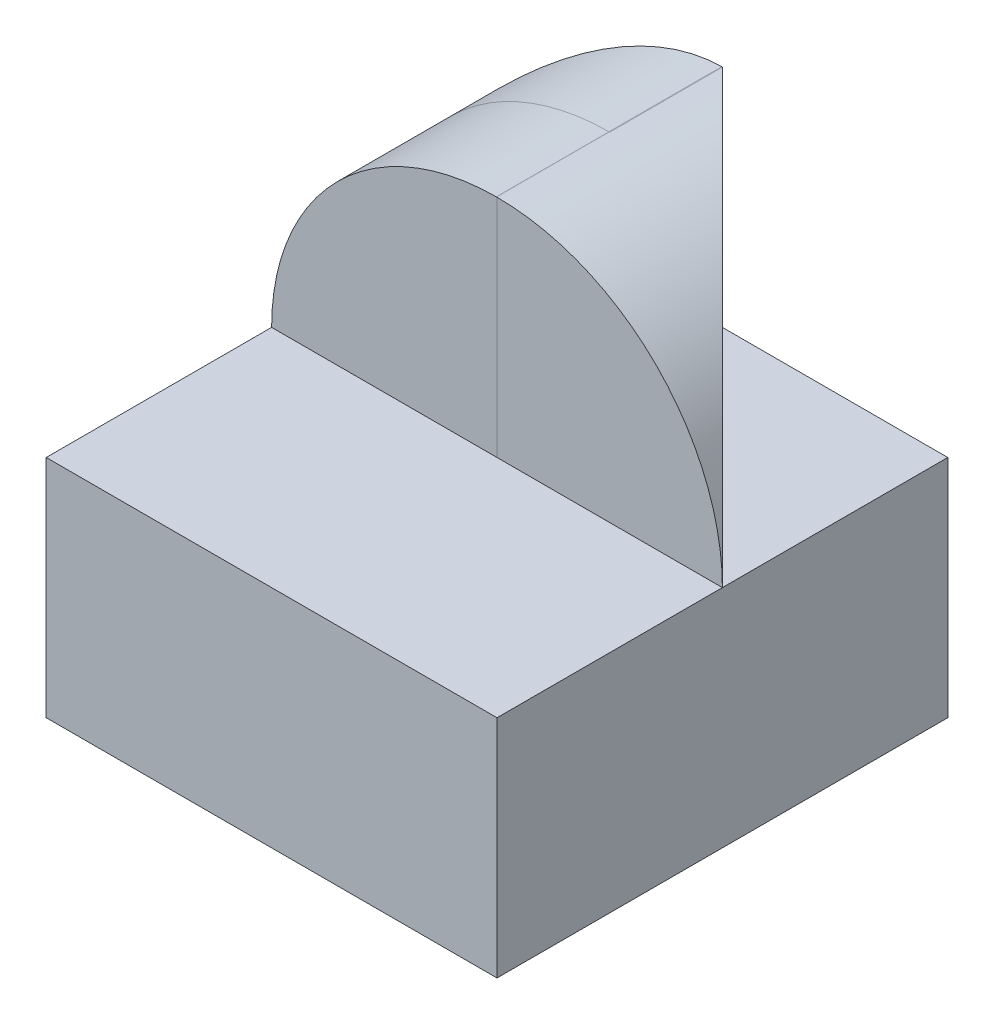
ISO-10303-21;
HEADER;
FILE_DESCRIPTION(('STEP AP214'),'2;1');
FILE_NAME('part.step','',(''),(''),'','','');
FILE_SCHEMA(('AUTOMOTIVE_DESIGN { 1 0 10303 214 1 1 1 1 }'));
ENDSEC;
DATA;
#1=APPLICATION_CONTEXT('core data for automotive mechanical design processes');
#2=APPLICATION_PROTOCOL_DEFINITION('international standard','automotive_design',2000,#1);
#3=PRODUCT_CONTEXT('',#1,'mechanical');
#4=PRODUCT('Part','Part','',(#3));
#5=PRODUCT_RELATED_PRODUCT_CATEGORY('part','',(#4));
#6=PRODUCT_DEFINITION_FORMATION('','',#4);
#7=PRODUCT_DEFINITION_CONTEXT('part definition',#1,'design');
#8=PRODUCT_DEFINITION('design','',#6,#7);
#9=PRODUCT_DEFINITION_SHAPE('','',#8);
#10=(LENGTH_UNIT() NAMED_UNIT(*) SI_UNIT(.MILLI.,.METRE.));
#11=(NAMED_UNIT(*) PLANE_ANGLE_UNIT() SI_UNIT($,.RADIAN.));
#12=(NAMED_UNIT(*) SI_UNIT($,.STERADIAN.) SOLID_ANGLE_UNIT());
#13=UNCERTAINTY_MEASURE_WITH_UNIT(LENGTH_MEASURE(1.E-05),#10,'distance_accuracy_value','');
#14=(GEOMETRIC_REPRESENTATION_CONTEXT(3) GLOBAL_UNCERTAINTY_ASSIGNED_CONTEXT((#13)) GLOBAL_UNIT_ASSIGNED_CONTEXT((#10,
#11,#12)) REPRESENTATION_CONTEXT('',''));
#15=CARTESIAN_POINT('',(0.,0.,0.));
#16=DIRECTION('',(0.,0.,1.));
#17=DIRECTION('',(1.,0.,0.));
#18=AXIS2_PLACEMENT_3D('',#15,#16,#17);
#19=CARTESIAN_POINT('',(20.,20.,10.));
#20=DIRECTION('',(0.,0.,-1.));
#21=DIRECTION('',(-1.,0.,0.));
#22=AXIS2_PLACEMENT_3D('',#19,#20,#21);
#23=CYLINDRICAL_SURFACE('',#22,20.);
#24=DIRECTION('',(0.,0.,-1.));
#25=VECTOR('',#24,1.);
#26=CARTESIAN_POINT('',(19.9593995923393,39.99995879013,10.));
#27=LINE('',#26,#25);
#28=CARTESIAN_POINT('',(19.9593995923393,39.9999587901298,19.9999));
#29=VERTEX_POINT('',#28);
#30=CARTESIAN_POINT('',(19.9593995923393,39.999929395065,10.));
#31=VERTEX_POINT('',#30);
#32=EDGE_CURVE('E211',#29,#31,#27,.T.);
#33=ORIENTED_EDGE('',*,*,#32,.F.);
#34=CARTESIAN_POINT('',(19.9999999999998,20.,19.9999));
#35=DIRECTION('',(0.,0.,-1.));
#36=DIRECTION('',(-1.,0.,0.));
#37=AXIS2_PLACEMENT_3D('',#34,#35,#36);
#38=CIRCLE('',#37,19.9999999999998);
#39=CARTESIAN_POINT('',(19.9999427197359,40.000000002177,19.9998289562371));
#40=VERTEX_POINT('',#39);
#41=EDGE_CURVE('E216',#40,#29,#38,.F.);
#42=ORIENTED_EDGE('',*,*,#41,.F.);
#43=CARTESIAN_POINT('',(20.,20.,20.));
#44=DIRECTION('',(0.,0.,-1.));
#45=DIRECTION('',(1.,0.,0.));
#46=AXIS2_PLACEMENT_3D('',#43,#44,#45);
#47=CIRCLE('',#46,20.);
#48=CARTESIAN_POINT('',(39.9999999875,20.0009999999994,20.));
#49=VERTEX_POINT('',#48);
#50=EDGE_CURVE('E389',#40,#49,#47,.T.);
#51=ORIENTED_EDGE('',*,*,#50,.T.);
#52=CARTESIAN_POINT('',(40.,20.,20.));
#53=VERTEX_POINT('',#52);
#54=EDGE_CURVE('E447',#49,#53,#47,.T.);
#55=ORIENTED_EDGE('',*,*,#54,.T.);
#56=CARTESIAN_POINT('',(20.,20.,2.16840434497101E-13));
#57=DIRECTION('',(-0.707106781186544,0.,0.707106781186551));
#58=DIRECTION('',(-0.707106781186551,0.,-0.707106781186544));
#59=AXIS2_PLACEMENT_3D('',#56,#57,#58);
#60=ELLIPSE('',#59,28.2842712474617,20.);
#61=CARTESIAN_POINT('',(39.999999975,20.0009999999975,19.999999975));
#62=VERTEX_POINT('',#61);
#63=EDGE_CURVE('E438',#62,#53,#60,.F.);
#64=ORIENTED_EDGE('',*,*,#63,.F.);
#65=CARTESIAN_POINT('',(20.0002057949251,39.9999999989412,0.000205794925286198));
#66=VERTEX_POINT('',#65);
#67=EDGE_CURVE('E397',#66,#62,#60,.F.);
#68=ORIENTED_EDGE('',*,*,#67,.F.);
#69=DIRECTION('',(0.,0.,-1.));
#70=VECTOR('',#69,1.);
#71=CARTESIAN_POINT('',(20.0002057949251,39.9999999989412,10.));
#72=LINE('',#71,#70);
#73=CARTESIAN_POINT('',(20.0000854952938,40.0000050290785,10.));
#74=VERTEX_POINT('',#73);
#75=EDGE_CURVE('E913',#66,#74,#72,.F.);
#76=ORIENTED_EDGE('',*,*,#75,.T.);
#77=CARTESIAN_POINT('',(19.9820446588261,39.9999,10.));
#78=DIRECTION('',(1.,0.,0.));
#79=VECTOR('',#78,1.);
#80=LINE('',#77,#79);
#81=CARTESIAN_POINT('',(19.9820446588261,39.9999060448939,10.));
#82=VERTEX_POINT('',#81);
#83=EDGE_CURVE('E242',#82,#74,#80,.T.);
#84=ORIENTED_EDGE('',*,*,#83,.F.);
#85=CARTESIAN_POINT('',(19.9593995923393,39.9999,10.));
#86=DIRECTION('',(1.,0.,0.));
#87=VECTOR('',#86,1.);
#88=LINE('',#85,#87);
#89=EDGE_CURVE('E53',#31,#82,#88,.T.);
#90=ORIENTED_EDGE('',*,*,#89,.F.);
#91=EDGE_LOOP('',(#33,#42,#51,#55,#64,#68,#76,#84,#90));
#92=FACE_BOUND('',#91,.T.);
#93=ADVANCED_FACE('F33',(#92),#23,.T.);
#94=CARTESIAN_POINT('',(19.9999999999998,20.,20.0005108840137));
#95=DIRECTION('',(7.27600485452626E-06,0.707112174351493,0.707101387943033));
#96=DIRECTION('',(-7.27589386473492E-06,-0.7071013879056,0.707112174388927));
#97=AXIS2_PLACEMENT_3D('',#94,#95,#96);
#98=ELLIPSE('',#97,28.2844869788476,19.9999999999998);
#99=CARTESIAN_POINT('',(2.67985945387078,30.0006365528588,9.9999));
#100=VERTEX_POINT('',#99);
#101=CARTESIAN_POINT('',(19.9367545259181,39.9999,0.000306448299358166));
#102=VERTEX_POINT('',#101);
#103=EDGE_CURVE('E252',#100,#102,#98,.F.);
#104=ORIENTED_EDGE('',*,*,#103,.F.);
#105=CARTESIAN_POINT('',(19.9999999999998,19.9999999999981,9.9999));
#106=DIRECTION('',(0.,0.,1.));
#107=DIRECTION('',(1.,0.,0.));
#108=AXIS2_PLACEMENT_3D('',#105,#106,#107);
#109=CIRCLE('',#108,20.0000000000019);
#110=CARTESIAN_POINT('',(19.9367545258525,39.9999,9.9999));
#111=VERTEX_POINT('',#110);
#112=EDGE_CURVE('E227',#111,#100,#109,.T.);
#113=ORIENTED_EDGE('',*,*,#112,.F.);
#114=DIRECTION('',(0.,0.,-1.));
#115=VECTOR('',#114,1.);
#116=CARTESIAN_POINT('',(19.9367545258525,39.9999,10.));
#117=LINE('',#116,#115);
#118=EDGE_CURVE('E247',#111,#102,#117,.T.);
#119=ORIENTED_EDGE('',*,*,#118,.T.);
#120=EDGE_LOOP('',(#104,#113,#119));
#121=FACE_BOUND('',#120,.T.);
#122=ADVANCED_FACE('F542',(#121),#23,.T.);
#123=CARTESIAN_POINT('',(-2979.99999983804,20.0311743276517,20.0002057904996));
#124=DIRECTION('',(7.27600485452626E-06,0.707112174351493,0.707101387943033));
#125=DIRECTION('',(0.,-0.70710138796175,0.70711217437021));
#126=AXIS2_PLACEMENT_3D('',#123,#124,#125);
#127=PLANE('',#126);
#128=DIRECTION('',(0.999999999947061,-1.02897462638287E-05,0.));
#129=VECTOR('',#128,1.);
#130=CARTESIAN_POINT('',(-2979.999896939,30.03132757074,9.9999));
#131=LINE('',#130,#129);
#132=CARTESIAN_POINT('',(19.9683756544016,30.0004586584138,9.9999));
#133=VERTEX_POINT('',#132);
#134=EDGE_CURVE('E237',#100,#133,#131,.T.);
#135=ORIENTED_EDGE('',*,*,#134,.F.);
#136=ORIENTED_EDGE('',*,*,#103,.T.);
#137=DIRECTION('',(-0.999999999947059,0.,1.02899032277493E-05));
#138=VECTOR('',#137,1.);
#139=CARTESIAN_POINT('',(-2980.00020531743,39.9999,0.0311755093071291));
#140=LINE('',#139,#138);
#141=CARTESIAN_POINT('',(20.,39.99995,0.000255796746828963));
#142=VERTEX_POINT('',#141);
#143=EDGE_CURVE('E11',#142,#102,#140,.T.);
#144=ORIENTED_EDGE('',*,*,#143,.F.);
#145=DIRECTION('',(0.999999999947061,-1.0289746263742E-05,0.));
#146=VECTOR('',#145,1.);
#147=CARTESIAN_POINT('',(0.000205795983861806,40.0002057938665,0.000205794925287933));
#148=LINE('',#147,#146);
#149=EDGE_CURVE('E273',#142,#66,#148,.T.);
#150=ORIENTED_EDGE('',*,*,#149,.T.);
#151=DIRECTION('',(-7.27589386462909E-06,-0.7071013879056,0.707112174388927));
#152=VECTOR('',#151,1.);
#153=CARTESIAN_POINT('',(20.0000000031391,20.0003050888605,20.0002057904993));
#154=LINE('',#153,#152);
#155=CARTESIAN_POINT('',(20.0000000102896,20.0010000010587,19.9995108677005));
#156=VERTEX_POINT('',#155);
#157=EDGE_CURVE('E272',#66,#156,#154,.T.);
#158=ORIENTED_EDGE('',*,*,#157,.T.);
#159=DIRECTION('',(0.99999999994706,-1.0289746263742E-05,0.));
#160=VECTOR('',#159,1.);
#161=CARTESIAN_POINT('',(-2979.99999983089,20.0318692398499,19.9995108677008));
#162=LINE('',#161,#160);
#163=CARTESIAN_POINT('',(-0.000143499421172494,20.0003165753148,19.9999907034279));
#164=VERTEX_POINT('',#163);
#165=EDGE_CURVE('E276',#164,#156,#162,.T.);
#166=ORIENTED_EDGE('',*,*,#165,.F.);
#167=CARTESIAN_POINT('',(2.67980171555224,30.0005365549783,10.));
#168=VERTEX_POINT('',#167);
#169=EDGE_CURVE('E253',#164,#168,#98,.F.);
#170=ORIENTED_EDGE('',*,*,#169,.T.);
#171=DIRECTION('',(0.999999999947061,-1.02897462638287E-05,0.));
#172=VECTOR('',#171,1.);
#173=CARTESIAN_POINT('',(-2979.99989694003,30.0312275722654,10.));
#174=LINE('',#173,#172);
#175=CARTESIAN_POINT('',(19.9683759706259,30.000358659936,10.));
#176=VERTEX_POINT('',#175);
#177=EDGE_CURVE('E230',#168,#176,#174,.T.);
#178=ORIENTED_EDGE('',*,*,#177,.T.);
#179=DIRECTION('',(-0.00223605375418481,0.707099631732948,-0.707110395105841));
#180=VECTOR('',#179,1.);
#181=CARTESIAN_POINT('',(19.9849504183027,24.7590777527241,15.2413606892657));
#182=LINE('',#181,#180);
#183=EDGE_CURVE('E239',#176,#133,#182,.T.);
#184=ORIENTED_EDGE('',*,*,#183,.T.);
#185=EDGE_LOOP('',(#135,#136,#144,#150,#158,#166,#170,#178,#184));
#186=FACE_BOUND('',#185,.T.);
#187=ADVANCED_FACE('F310',(#186),#127,.F.);
#188=CARTESIAN_POINT('',(20.0002057951134,40.0000183034798,-10.));
#189=DIRECTION('',(-0.999999999947061,1.0289746263742E-05,0.));
#190=DIRECTION('',(-1.0289746263742E-05,-0.999999999947061,0.));
#191=AXIS2_PLACEMENT_3D('',#188,#189,#190);
#192=PLANE('',#191);
#193=ORIENTED_EDGE('',*,*,#157,.F.);
#194=DIRECTION('',(-1.02897462631972E-05,-0.999999999894121,-1.02897462631971E-05));
#195=VECTOR('',#194,1.);
#196=CARTESIAN_POINT('',(20.0008437570757,101.999794187711,0.000843757075926627));
#197=LINE('',#196,#195);
#198=CARTESIAN_POINT('',(19.9999999999998,20.,0.));
#199=VERTEX_POINT('',#198);
#200=EDGE_CURVE('E532',#66,#199,#197,.T.);
#201=ORIENTED_EDGE('',*,*,#200,.T.);
#202=DIRECTION('',(0.,0.,-1.));
#203=VECTOR('',#202,1.);
#204=CARTESIAN_POINT('',(19.9999999999998,20.,0.));
#205=LINE('',#204,#203);
#206=CARTESIAN_POINT('',(19.9999999999998,19.9999999999981,10.));
#207=VERTEX_POINT('',#206);
#208=EDGE_CURVE('E526',#207,#199,#205,.T.);
#209=ORIENTED_EDGE('',*,*,#208,.F.);
#210=DIRECTION('',(-1.0289746263742E-05,-0.999999999947061,0.));
#211=VECTOR('',#210,1.);
#212=CARTESIAN_POINT('',(20.0002057951134,40.0000183034798,10.));
#213=LINE('',#212,#211);
#214=CARTESIAN_POINT('',(20.0000000102896,20.0010000010587,10.));
#215=VERTEX_POINT('',#214);
#216=EDGE_CURVE('E285',#215,#207,#213,.T.);
#217=ORIENTED_EDGE('',*,*,#216,.F.);
#218=DIRECTION('',(0.,0.,1.));
#219=VECTOR('',#218,1.);
#220=CARTESIAN_POINT('',(20.0000000102896,20.0010000010587,0.));
#221=LINE('',#220,#219);
#222=EDGE_CURVE('E268',#215,#156,#221,.T.);
#223=ORIENTED_EDGE('',*,*,#222,.T.);
#224=EDGE_LOOP('',(#193,#201,#209,#217,#223));
#225=FACE_BOUND('',#224,.T.);
#226=ADVANCED_FACE('F312',(#225),#192,.T.);
#227=CARTESIAN_POINT('',(19.9999999999998,40.,10.));
#228=DIRECTION('',(0.,0.,-1.));
#229=DIRECTION('',(-1.,0.,0.));
#230=AXIS2_PLACEMENT_3D('',#227,#228,#229);
#231=PLANE('',#230);
#232=DIRECTION('',(1.,0.,0.));
#233=VECTOR('',#232,1.);
#234=CARTESIAN_POINT('',(0.,20.,10.));
#235=LINE('',#234,#233);
#236=CARTESIAN_POINT('',(-0.000467023133326176,20.0009611747016,9.99999999999999));
#237=VERTEX_POINT('',#236);
#238=EDGE_CURVE('E45',#237,#207,#235,.T.);
#239=ORIENTED_EDGE('',*,*,#238,.F.);
#240=DIRECTION('',(0.99999999994706,-1.0289746263742E-05,0.));
#241=VECTOR('',#240,1.);
#242=CARTESIAN_POINT('',(-2979.99999983089,20.0318692398499,10.0000000000003));
#243=LINE('',#242,#241);
#244=EDGE_CURVE('E282',#237,#215,#243,.T.);
#245=ORIENTED_EDGE('',*,*,#244,.T.);
#246=ORIENTED_EDGE('',*,*,#216,.T.);
#247=EDGE_LOOP('',(#239,#245,#246));
#248=FACE_BOUND('',#247,.T.);
#249=ADVANCED_FACE('F315',(#248),#231,.T.);
#250=DIRECTION('',(0.,0.,-1.));
#251=VECTOR('',#250,1.);
#252=CARTESIAN_POINT('',(19.9367545258525,39.9999,10.));
#253=LINE('',#252,#251);
#254=CARTESIAN_POINT('',(19.9367545258525,39.9999,10.));
#255=VERTEX_POINT('',#254);
#256=CARTESIAN_POINT('',(19.9367545259183,39.9999,19.9999));
#257=VERTEX_POINT('',#256);
#258=EDGE_CURVE('E202',#255,#257,#253,.F.);
#259=ORIENTED_EDGE('',*,*,#258,.F.);
#260=CARTESIAN_POINT('',(19.9999999999998,19.9999999999981,10.));
#261=DIRECTION('',(0.,0.,1.));
#262=DIRECTION('',(1.,0.,0.));
#263=AXIS2_PLACEMENT_3D('',#260,#261,#262);
#264=CIRCLE('',#263,20.0000000000019);
#265=EDGE_CURVE('E228',#255,#168,#264,.T.);
#266=ORIENTED_EDGE('',*,*,#265,.T.);
#267=ORIENTED_EDGE('',*,*,#169,.F.);
#268=EDGE_CURVE('E256',#257,#164,#38,.F.);
#269=ORIENTED_EDGE('',*,*,#268,.F.);
#270=EDGE_LOOP('',(#259,#266,#267,#269));
#271=FACE_BOUND('',#270,.T.);
#272=ADVANCED_FACE('F337',(#271),#23,.T.);
#273=CARTESIAN_POINT('',(9.99999999999979,102.,-9.99999999999989));
#274=DIRECTION('',(-0.707106781186544,0.,0.707106781186551));
#275=DIRECTION('',(0.707106781186551,0.,0.707106781186544));
#276=AXIS2_PLACEMENT_3D('',#273,#274,#275);
#277=PLANE('',#276);
#278=ORIENTED_EDGE('',*,*,#200,.F.);
#279=ORIENTED_EDGE('',*,*,#67,.T.);
#280=ORIENTED_EDGE('',*,*,#63,.T.);
#281=DIRECTION('',(0.707106781186551,0.,0.707106781186544));
#282=VECTOR('',#281,1.);
#283=CARTESIAN_POINT('',(19.9999999999998,20.,0.));
#284=LINE('',#283,#282);
#285=EDGE_CURVE('E493',#199,#53,#284,.T.);
#286=ORIENTED_EDGE('',*,*,#285,.F.);
#287=EDGE_LOOP('',(#278,#279,#280,#286));
#288=FACE_BOUND('',#287,.T.);
#289=ADVANCED_FACE('F530',(#288),#277,.F.);
#290=CARTESIAN_POINT('',(42.,20.,20.));
#291=DIRECTION('',(0.,0.,1.));
#292=DIRECTION('',(1.,0.,0.));
#293=AXIS2_PLACEMENT_3D('',#290,#291,#292);
#294=PLANE('',#293);
#295=DIRECTION('',(-0.70693002659386,-0.707283491607153,0.));
#296=VECTOR('',#295,1.);
#297=CARTESIAN_POINT('',(40.9919216222216,21.0075745904832,20.));
#298=LINE('',#297,#296);
#299=CARTESIAN_POINT('',(20.,0.00515700745054234,20.));
#300=VERTEX_POINT('',#299);
#301=CARTESIAN_POINT('',(19.9948455697646,0.,20.));
#302=VERTEX_POINT('',#301);
#303=EDGE_CURVE('E411',#300,#302,#298,.T.);
#304=ORIENTED_EDGE('',*,*,#303,.F.);
#305=DIRECTION('',(0.,-1.,0.));
#306=VECTOR('',#305,1.);
#307=CARTESIAN_POINT('',(20.,20.,20.));
#308=LINE('',#307,#306);
#309=CARTESIAN_POINT('',(20.,0.,20.));
#310=VERTEX_POINT('',#309);
#311=EDGE_CURVE('E593',#300,#310,#308,.T.);
#312=ORIENTED_EDGE('',*,*,#311,.T.);
#313=DIRECTION('',(-1.,0.,0.));
#314=VECTOR('',#313,1.);
#315=CARTESIAN_POINT('',(42.,0.,20.));
#316=LINE('',#315,#314);
#317=EDGE_CURVE('E491',#310,#302,#316,.T.);
#318=ORIENTED_EDGE('',*,*,#317,.T.);
#319=EDGE_LOOP('',(#304,#312,#318));
#320=FACE_BOUND('',#319,.T.);
#321=ADVANCED_FACE('F554',(#320),#294,.F.);
#322=CARTESIAN_POINT('',(42.,20.,10.));
#323=DIRECTION('',(0.,0.,-1.));
#324=DIRECTION('',(0.,1.,0.));
#325=AXIS2_PLACEMENT_3D('',#322,#323,#324);
#326=PLANE('',#325);
#327=DIRECTION('',(0.707106781186547,-0.707106781186548,0.));
#328=VECTOR('',#327,1.);
#329=CARTESIAN_POINT('',(0.,20.,10.));
#330=LINE('',#329,#328);
#331=CARTESIAN_POINT('',(19.9974221407395,0.00257785926045459,10.));
#332=VERTEX_POINT('',#331);
#333=CARTESIAN_POINT('',(20.,0.,10.));
#334=VERTEX_POINT('',#333);
#335=EDGE_CURVE('E381',#332,#334,#330,.T.);
#336=ORIENTED_EDGE('',*,*,#335,.T.);
#337=DIRECTION('',(0.,1.,0.));
#338=VECTOR('',#337,1.);
#339=CARTESIAN_POINT('',(20.,20.,10.));
#340=LINE('',#339,#338);
#341=CARTESIAN_POINT('',(20.,0.00515700745054234,10.));
#342=VERTEX_POINT('',#341);
#343=EDGE_CURVE('E598',#334,#342,#340,.T.);
#344=ORIENTED_EDGE('',*,*,#343,.T.);
#345=DIRECTION('',(0.70693002659386,0.707283491607153,0.));
#346=VECTOR('',#345,1.);
#347=CARTESIAN_POINT('',(40.9919216222216,21.0075745904832,10.));
#348=LINE('',#347,#346);
#349=EDGE_CURVE('E405',#332,#342,#348,.T.);
#350=ORIENTED_EDGE('',*,*,#349,.F.);
#351=EDGE_LOOP('',(#336,#344,#350));
#352=FACE_BOUND('',#351,.T.);
#353=ADVANCED_FACE('F612',(#352),#326,.F.);
#354=CARTESIAN_POINT('',(0.,0.,40.));
#355=DIRECTION('',(1.,0.,0.));
#356=DIRECTION('',(0.,0.,-1.));
#357=AXIS2_PLACEMENT_3D('',#354,#355,#356);
#358=PLANE('',#357);
#359=DIRECTION('',(0.,0.,-1.));
#360=VECTOR('',#359,1.);
#361=CARTESIAN_POINT('',(0.,0.,40.));
#362=LINE('',#361,#360);
#363=CARTESIAN_POINT('',(0.,0.,40.));
#364=VERTEX_POINT('',#363);
#365=CARTESIAN_POINT('',(0.,0.,20.0004268024548));
#366=VERTEX_POINT('',#365);
#367=EDGE_CURVE('E486',#364,#366,#362,.T.);
#368=ORIENTED_EDGE('',*,*,#367,.F.);
#369=DIRECTION('',(0.,-1.,0.));
#370=VECTOR('',#369,1.);
#371=CARTESIAN_POINT('',(0.,0.,40.));
#372=LINE('',#371,#370);
#373=CARTESIAN_POINT('',(0.,20.001,40.));
#374=VERTEX_POINT('',#373);
#375=EDGE_CURVE('E489',#374,#364,#372,.T.);
#376=ORIENTED_EDGE('',*,*,#375,.F.);
#377=DIRECTION('',(0.,0.,1.));
#378=VECTOR('',#377,1.);
#379=CARTESIAN_POINT('',(0.,20.001,20.));
#380=LINE('',#379,#378);
#381=EDGE_CURVE('E429',#164,#374,#380,.T.);
#382=ORIENTED_EDGE('',*,*,#381,.F.);
#383=DIRECTION('',(0.,1.,0.));
#384=VECTOR('',#383,1.);
#385=CARTESIAN_POINT('',(0.,0.,20.0004268024548));
#386=LINE('',#385,#384);
#387=EDGE_CURVE('E416',#366,#164,#386,.T.);
#388=ORIENTED_EDGE('',*,*,#387,.F.);
#389=EDGE_LOOP('',(#368,#376,#382,#388));
#390=FACE_BOUND('',#389,.T.);
#391=ADVANCED_FACE('F512',(#390),#358,.F.);
#392=CARTESIAN_POINT('',(0.,0.,0.));
#393=DIRECTION('',(0.,0.,-1.));
#394=DIRECTION('',(-1.,0.,0.));
#395=AXIS2_PLACEMENT_3D('',#392,#393,#394);
#396=PLANE('',#395);
#397=DIRECTION('',(-1.,0.,0.));
#398=VECTOR('',#397,1.);
#399=CARTESIAN_POINT('',(0.,20.,0.));
#400=LINE('',#399,#398);
#401=CARTESIAN_POINT('',(0.,20.,0.));
#402=VERTEX_POINT('',#401);
#403=EDGE_CURVE('E523',#199,#402,#400,.T.);
#404=ORIENTED_EDGE('',*,*,#403,.F.);
#405=DIRECTION('',(-1.,0.,0.));
#406=VECTOR('',#405,1.);
#407=CARTESIAN_POINT('',(40.,20.,0.));
#408=LINE('',#407,#406);
#409=CARTESIAN_POINT('',(40.,20.,0.));
#410=VERTEX_POINT('',#409);
#411=EDGE_CURVE('E495',#410,#199,#408,.T.);
#412=ORIENTED_EDGE('',*,*,#411,.F.);
#413=DIRECTION('',(0.,1.,0.));
#414=VECTOR('',#413,1.);
#415=CARTESIAN_POINT('',(40.,0.,0.));
#416=LINE('',#415,#414);
#417=CARTESIAN_POINT('',(40.,0.,0.));
#418=VERTEX_POINT('',#417);
#419=EDGE_CURVE('E437',#418,#410,#416,.T.);
#420=ORIENTED_EDGE('',*,*,#419,.F.);
#421=DIRECTION('',(1.,0.,0.));
#422=VECTOR('',#421,1.);
#423=CARTESIAN_POINT('',(0.,0.,0.));
#424=LINE('',#423,#422);
#425=CARTESIAN_POINT('',(20.,0.,0.));
#426=VERTEX_POINT('',#425);
#427=EDGE_CURVE('E428',#426,#418,#424,.T.);
#428=ORIENTED_EDGE('',*,*,#427,.F.);
#429=DIRECTION('',(0.707106781186547,-0.707106781186548,0.));
#430=VECTOR('',#429,1.);
#431=CARTESIAN_POINT('',(0.,20.,0.));
#432=LINE('',#431,#430);
#433=CARTESIAN_POINT('',(19.9974221407395,0.00257785926045806,0.));
#434=VERTEX_POINT('',#433);
#435=EDGE_CURVE('E385',#434,#426,#432,.T.);
#436=ORIENTED_EDGE('',*,*,#435,.F.);
#437=DIRECTION('',(0.70693002659386,0.707283491607153,0.));
#438=VECTOR('',#437,1.);
#439=CARTESIAN_POINT('',(5.86381846534464,-14.1380926179721,0.));
#440=LINE('',#439,#438);
#441=CARTESIAN_POINT('',(20.,0.00515700745054495,0.));
#442=VERTEX_POINT('',#441);
#443=EDGE_CURVE('E403',#434,#442,#440,.T.);
#444=ORIENTED_EDGE('',*,*,#443,.T.);
#445=DIRECTION('',(0.,-1.,0.));
#446=VECTOR('',#445,1.);
#447=CARTESIAN_POINT('',(20.,20.,0.));
#448=LINE('',#447,#446);
#449=CARTESIAN_POINT('',(20.,0.00999500249865108,0.));
#450=VERTEX_POINT('',#449);
#451=EDGE_CURVE('E585',#450,#442,#448,.T.);
#452=ORIENTED_EDGE('',*,*,#451,.F.);
#453=DIRECTION('',(0.707283491607153,-0.70693002659386,0.));
#454=VECTOR('',#453,1.);
#455=CARTESIAN_POINT('',(-3.66085223489632E-05,20.0000365902272,0.));
#456=LINE('',#455,#454);
#457=EDGE_CURVE('E396',#402,#450,#456,.T.);
#458=ORIENTED_EDGE('',*,*,#457,.F.);
#459=EDGE_LOOP('',(#404,#412,#420,#428,#436,#444,#452,#458));
#460=FACE_BOUND('',#459,.T.);
#461=ADVANCED_FACE('F355',(#460),#396,.T.);
#462=CARTESIAN_POINT('',(0.,20.,10.));
#463=DIRECTION('',(0.707106781186548,0.707106781186547,0.));
#464=DIRECTION('',(-0.707106781186547,0.707106781186548,0.));
#465=AXIS2_PLACEMENT_3D('',#462,#463,#464);
#466=PLANE('',#465);
#467=DIRECTION('',(0.,0.,1.));
#468=VECTOR('',#467,1.);
#469=CARTESIAN_POINT('',(19.9974221407395,0.00257785926045459,10.));
#470=LINE('',#469,#468);
#471=EDGE_CURVE('E386',#434,#332,#470,.T.);
#472=ORIENTED_EDGE('',*,*,#471,.F.);
#473=ORIENTED_EDGE('',*,*,#435,.T.);
#474=DIRECTION('',(0.,0.,-1.));
#475=VECTOR('',#474,1.);
#476=CARTESIAN_POINT('',(20.,0.,10.));
#477=LINE('',#476,#475);
#478=EDGE_CURVE('E384',#334,#426,#477,.T.);
#479=ORIENTED_EDGE('',*,*,#478,.F.);
#480=ORIENTED_EDGE('',*,*,#335,.F.);
#481=EDGE_LOOP('',(#472,#473,#479,#480));
#482=FACE_BOUND('',#481,.T.);
#483=ADVANCED_FACE('F351',(#482),#466,.F.);
#484=CARTESIAN_POINT('',(0.,20.001,0.));
#485=DIRECTION('',(0.,-1.,0.));
#486=DIRECTION('',(0.,0.,-1.));
#487=AXIS2_PLACEMENT_3D('',#484,#485,#486);
#488=PLANE('',#487);
#489=DIRECTION('',(-1.,0.,0.));
#490=VECTOR('',#489,1.);
#491=CARTESIAN_POINT('',(40.,20.001,20.));
#492=LINE('',#491,#490);
#493=CARTESIAN_POINT('',(19.999985993593,20.001,20.));
#494=VERTEX_POINT('',#493);
#495=EDGE_CURVE('E454',#49,#494,#492,.T.);
#496=ORIENTED_EDGE('',*,*,#495,.T.);
#497=DIRECTION('',(1.,0.,0.));
#498=VECTOR('',#497,1.);
#499=CARTESIAN_POINT('',(0.,20.001,20.));
#500=LINE('',#499,#498);
#501=EDGE_CURVE('E513',#164,#494,#500,.T.);
#502=ORIENTED_EDGE('',*,*,#501,.F.);
#503=ORIENTED_EDGE('',*,*,#381,.T.);
#504=DIRECTION('',(1.,0.,0.));
#505=VECTOR('',#504,1.);
#506=CARTESIAN_POINT('',(40.,20.001,40.));
#507=LINE('',#506,#505);
#508=CARTESIAN_POINT('',(40.,20.001,40.));
#509=VERTEX_POINT('',#508);
#510=EDGE_CURVE('E425',#374,#509,#507,.T.);
#511=ORIENTED_EDGE('',*,*,#510,.T.);
#512=DIRECTION('',(0.,0.,-1.));
#513=VECTOR('',#512,1.);
#514=CARTESIAN_POINT('',(40.,20.001,20.));
#515=LINE('',#514,#513);
#516=EDGE_CURVE('E424',#509,#49,#515,.T.);
#517=ORIENTED_EDGE('',*,*,#516,.T.);
#518=EDGE_LOOP('',(#496,#502,#503,#511,#517));
#519=FACE_BOUND('',#518,.T.);
#520=ADVANCED_FACE('F354',(#519),#488,.F.);
#521=CARTESIAN_POINT('',(20.,20.,20.));
#522=DIRECTION('',(0.,0.,1.));
#523=DIRECTION('',(1.,0.,0.));
#524=AXIS2_PLACEMENT_3D('',#521,#522,#523);
#525=PLANE('',#524);
#526=DIRECTION('',(-1.94562443964553E-05,0.999999999810727,0.));
#527=VECTOR('',#526,1.);
#528=CARTESIAN_POINT('',(19.9999860011639,20.0006108748392,20.));
#529=LINE('',#528,#527);
#530=EDGE_CURVE('E472',#494,#40,#529,.T.);
#531=ORIENTED_EDGE('',*,*,#530,.F.);
#532=ORIENTED_EDGE('',*,*,#495,.F.);
#533=ORIENTED_EDGE('',*,*,#50,.F.);
#534=EDGE_LOOP('',(#531,#532,#533));
#535=FACE_BOUND('',#534,.T.);
#536=ADVANCED_FACE('F359',(#535),#525,.T.);
#537=CARTESIAN_POINT('',(0.,0.,40.));
#538=DIRECTION('',(0.,0.,-1.));
#539=DIRECTION('',(-1.,0.,0.));
#540=AXIS2_PLACEMENT_3D('',#537,#538,#539);
#541=PLANE('',#540);
#542=DIRECTION('',(1.,0.,0.));
#543=VECTOR('',#542,1.);
#544=CARTESIAN_POINT('',(0.,0.,40.));
#545=LINE('',#544,#543);
#546=CARTESIAN_POINT('',(40.,0.,40.));
#547=VERTEX_POINT('',#546);
#548=EDGE_CURVE('E480',#364,#547,#545,.T.);
#549=ORIENTED_EDGE('',*,*,#548,.T.);
#550=DIRECTION('',(0.,1.,0.));
#551=VECTOR('',#550,1.);
#552=CARTESIAN_POINT('',(40.,0.,40.));
#553=LINE('',#552,#551);
#554=EDGE_CURVE('E479',#547,#509,#553,.T.);
#555=ORIENTED_EDGE('',*,*,#554,.T.);
#556=ORIENTED_EDGE('',*,*,#510,.F.);
#557=ORIENTED_EDGE('',*,*,#375,.T.);
#558=EDGE_LOOP('',(#549,#555,#556,#557));
#559=FACE_BOUND('',#558,.T.);
#560=ADVANCED_FACE('F35',(#559),#541,.F.);
#561=CARTESIAN_POINT('',(40.,0.,40.));
#562=DIRECTION('',(-1.,0.,0.));
#563=DIRECTION('',(0.,0.,1.));
#564=AXIS2_PLACEMENT_3D('',#561,#562,#563);
#565=PLANE('',#564);
#566=ORIENTED_EDGE('',*,*,#516,.F.);
#567=ORIENTED_EDGE('',*,*,#554,.F.);
#568=DIRECTION('',(0.,0.,-1.));
#569=VECTOR('',#568,1.);
#570=CARTESIAN_POINT('',(40.,0.,40.));
#571=LINE('',#570,#569);
#572=EDGE_CURVE('E483',#547,#418,#571,.T.);
#573=ORIENTED_EDGE('',*,*,#572,.T.);
#574=ORIENTED_EDGE('',*,*,#419,.T.);
#575=DIRECTION('',(0.,0.,-1.));
#576=VECTOR('',#575,1.);
#577=CARTESIAN_POINT('',(40.,20.,20.));
#578=LINE('',#577,#576);
#579=EDGE_CURVE('E433',#53,#410,#578,.T.);
#580=ORIENTED_EDGE('',*,*,#579,.F.);
#581=ORIENTED_EDGE('',*,*,#54,.F.);
#582=EDGE_LOOP('',(#566,#567,#573,#574,#580,#581));
#583=FACE_BOUND('',#582,.T.);
#584=ADVANCED_FACE('F474',(#583),#565,.F.);
#585=CARTESIAN_POINT('',(0.,0.,40.));
#586=DIRECTION('',(0.,1.,0.));
#587=DIRECTION('',(0.,0.,1.));
#588=AXIS2_PLACEMENT_3D('',#585,#586,#587);
#589=PLANE('',#588);
#590=ORIENTED_EDGE('',*,*,#317,.F.);
#591=DIRECTION('',(0.,0.,-1.));
#592=VECTOR('',#591,1.);
#593=CARTESIAN_POINT('',(20.,0.,0.));
#594=LINE('',#593,#592);
#595=EDGE_CURVE('E582',#310,#334,#594,.T.);
#596=ORIENTED_EDGE('',*,*,#595,.T.);
#597=ORIENTED_EDGE('',*,*,#478,.T.);
#598=ORIENTED_EDGE('',*,*,#427,.T.);
#599=ORIENTED_EDGE('',*,*,#572,.F.);
#600=ORIENTED_EDGE('',*,*,#548,.F.);
#601=ORIENTED_EDGE('',*,*,#367,.T.);
#602=DIRECTION('',(-1.,0.,0.));
#603=VECTOR('',#602,1.);
#604=CARTESIAN_POINT('',(0.,0.,20.0004268024548));
#605=LINE('',#604,#603);
#606=CARTESIAN_POINT('',(19.9948455697646,0.,20.0004268024548));
#607=VERTEX_POINT('',#606);
#608=EDGE_CURVE('E414',#607,#366,#605,.T.);
#609=ORIENTED_EDGE('',*,*,#608,.F.);
#610=DIRECTION('',(0.,0.,1.));
#611=VECTOR('',#610,1.);
#612=CARTESIAN_POINT('',(19.9948455697646,0.,40.));
#613=LINE('',#612,#611);
#614=EDGE_CURVE('E408',#302,#607,#613,.T.);
#615=ORIENTED_EDGE('',*,*,#614,.F.);
#616=EDGE_LOOP('',(#590,#596,#597,#598,#599,#600,#601,#609,#615));
#617=FACE_BOUND('',#616,.T.);
#618=ADVANCED_FACE('F518',(#617),#589,.F.);
#619=CARTESIAN_POINT('',(0.,20.,0.));
#620=DIRECTION('',(0.,1.,0.));
#621=DIRECTION('',(0.,0.,1.));
#622=AXIS2_PLACEMENT_3D('',#619,#620,#621);
#623=PLANE('',#622);
#624=ORIENTED_EDGE('',*,*,#411,.T.);
#625=ORIENTED_EDGE('',*,*,#285,.T.);
#626=ORIENTED_EDGE('',*,*,#579,.T.);
#627=EDGE_LOOP('',(#624,#625,#626));
#628=FACE_BOUND('',#627,.T.);
#629=ADVANCED_FACE('F365',(#628),#623,.T.);
#630=CARTESIAN_POINT('',(0.,20.,20.));
#631=DIRECTION('',(0.706930026593859,0.707283491607153,0.));
#632=DIRECTION('',(-0.707283491607153,0.706930026593859,0.));
#633=AXIS2_PLACEMENT_3D('',#630,#631,#632);
#634=PLANE('',#633);
#635=ORIENTED_EDGE('',*,*,#457,.T.);
#636=DIRECTION('',(0.,0.,1.));
#637=VECTOR('',#636,1.);
#638=CARTESIAN_POINT('',(20.,0.00999500249865282,20.));
#639=LINE('',#638,#637);
#640=CARTESIAN_POINT('',(20.,0.00999500249865976,20.0004268024548));
#641=VERTEX_POINT('',#640);
#642=EDGE_CURVE('E504',#450,#641,#639,.T.);
#643=ORIENTED_EDGE('',*,*,#642,.T.);
#644=DIRECTION('',(-0.707283491607153,0.70693002659386,0.));
#645=VECTOR('',#644,1.);
#646=CARTESIAN_POINT('',(-3.66085223489632E-05,20.0000365902272,20.0004268024548));
#647=LINE('',#646,#645);
#648=EDGE_CURVE('E391',#641,#164,#647,.T.);
#649=ORIENTED_EDGE('',*,*,#648,.T.);
#650=CARTESIAN_POINT('',(0.,20.,20.));
#651=DIRECTION('',(0.,0.,-1.));
#652=VECTOR('',#651,1.);
#653=LINE('',#650,#652);
#654=EDGE_CURVE('E290',#164,#237,#653,.T.);
#655=ORIENTED_EDGE('',*,*,#654,.T.);
#656=DIRECTION('',(0.,0.,-1.));
#657=VECTOR('',#656,1.);
#658=CARTESIAN_POINT('',(0.,20.,10.));
#659=LINE('',#658,#657);
#660=EDGE_CURVE('E430',#237,#402,#659,.T.);
#661=ORIENTED_EDGE('',*,*,#660,.T.);
#662=EDGE_LOOP('',(#635,#643,#649,#655,#661));
#663=FACE_BOUND('',#662,.T.);
#664=ADVANCED_FACE('F361',(#663),#634,.F.);
#665=CARTESIAN_POINT('',(5.86381846534464,-14.1380926179721,20.0004268024548));
#666=DIRECTION('',(-0.707283491607153,0.70693002659386,0.));
#667=DIRECTION('',(-0.70693002659386,-0.707283491607153,0.));
#668=AXIS2_PLACEMENT_3D('',#665,#666,#667);
#669=PLANE('',#668);
#670=DIRECTION('',(0.,0.,1.));
#671=VECTOR('',#670,1.);
#672=CARTESIAN_POINT('',(20.,0.00515700745054234,20.0004268024548));
#673=LINE('',#672,#671);
#674=EDGE_CURVE('E596',#442,#342,#673,.T.);
#675=ORIENTED_EDGE('',*,*,#674,.F.);
#676=ORIENTED_EDGE('',*,*,#443,.F.);
#677=ORIENTED_EDGE('',*,*,#471,.T.);
#678=ORIENTED_EDGE('',*,*,#349,.T.);
#679=EDGE_LOOP('',(#675,#676,#677,#678));
#680=FACE_BOUND('',#679,.T.);
#681=ADVANCED_FACE('F346',(#680),#669,.T.);
#682=CARTESIAN_POINT('',(-14.1386371403995,5.85436675808419,20.0004268024548));
#683=DIRECTION('',(0.,0.,-1.));
#684=DIRECTION('',(-1.,0.,0.));
#685=AXIS2_PLACEMENT_3D('',#682,#683,#684);
#686=PLANE('',#685);
#687=DIRECTION('',(0.,1.,0.));
#688=VECTOR('',#687,1.);
#689=CARTESIAN_POINT('',(20.,5.85436675808419,20.0004268024548));
#690=LINE('',#689,#688);
#691=CARTESIAN_POINT('',(20.,0.00515700745054234,20.0004268024548));
#692=VERTEX_POINT('',#691);
#693=EDGE_CURVE('E587',#692,#641,#690,.T.);
#694=ORIENTED_EDGE('',*,*,#693,.F.);
#695=DIRECTION('',(0.70693002659386,0.707283491607153,0.));
#696=VECTOR('',#695,1.);
#697=CARTESIAN_POINT('',(5.86381846534464,-14.1380926179721,20.0004268024548));
#698=LINE('',#697,#696);
#699=EDGE_CURVE('E395',#607,#692,#698,.T.);
#700=ORIENTED_EDGE('',*,*,#699,.F.);
#701=ORIENTED_EDGE('',*,*,#608,.T.);
#702=ORIENTED_EDGE('',*,*,#387,.T.);
#703=ORIENTED_EDGE('',*,*,#648,.F.);
#704=EDGE_LOOP('',(#694,#700,#701,#702,#703));
#705=FACE_BOUND('',#704,.T.);
#706=ADVANCED_FACE('F343',(#705),#686,.T.);
#707=DIRECTION('',(0.,0.,1.));
#708=VECTOR('',#707,1.);
#709=CARTESIAN_POINT('',(20.,0.00515700745054234,20.0004268024548));
#710=LINE('',#709,#708);
#711=EDGE_CURVE('E388',#300,#692,#710,.T.);
#712=ORIENTED_EDGE('',*,*,#711,.F.);
#713=ORIENTED_EDGE('',*,*,#303,.T.);
#714=ORIENTED_EDGE('',*,*,#614,.T.);
#715=ORIENTED_EDGE('',*,*,#699,.T.);
#716=EDGE_LOOP('',(#712,#713,#714,#715));
#717=FACE_BOUND('',#716,.T.);
#718=ADVANCED_FACE('F341',(#717),#669,.T.);
#719=CARTESIAN_POINT('',(20.,20.,0.));
#720=DIRECTION('',(-1.,0.,0.));
#721=DIRECTION('',(0.,0.,1.));
#722=AXIS2_PLACEMENT_3D('',#719,#720,#721);
#723=PLANE('',#722);
#724=ORIENTED_EDGE('',*,*,#343,.F.);
#725=ORIENTED_EDGE('',*,*,#595,.F.);
#726=ORIENTED_EDGE('',*,*,#311,.F.);
#727=ORIENTED_EDGE('',*,*,#711,.T.);
#728=ORIENTED_EDGE('',*,*,#693,.T.);
#729=ORIENTED_EDGE('',*,*,#642,.F.);
#730=ORIENTED_EDGE('',*,*,#451,.T.);
#731=ORIENTED_EDGE('',*,*,#674,.T.);
#732=EDGE_LOOP('',(#724,#725,#726,#727,#728,#729,#730,#731));
#733=FACE_BOUND('',#732,.T.);
#734=ADVANCED_FACE('F333',(#733),#723,.T.);
#735=CARTESIAN_POINT('',(0.,20.,0.));
#736=DIRECTION('',(0.,-1.,0.));
#737=DIRECTION('',(0.,0.,-1.));
#738=AXIS2_PLACEMENT_3D('',#735,#736,#737);
#739=PLANE('',#738);
#740=ORIENTED_EDGE('',*,*,#403,.T.);
#741=ORIENTED_EDGE('',*,*,#660,.F.);
#742=ORIENTED_EDGE('',*,*,#238,.T.);
#743=ORIENTED_EDGE('',*,*,#208,.T.);
#744=EDGE_LOOP('',(#740,#741,#742,#743));
#745=FACE_BOUND('',#744,.T.);
#746=ADVANCED_FACE('F320',(#745),#739,.F.);
#747=CARTESIAN_POINT('',(19.9999860011639,20.0006108748392,19.9999));
#748=DIRECTION('',(0.,0.,-1.));
#749=DIRECTION('',(-1.,0.,0.));
#750=AXIS2_PLACEMENT_3D('',#747,#748,#749);
#751=PLANE('',#750);
#752=ORIENTED_EDGE('',*,*,#41,.T.);
#753=DIRECTION('',(0.,-1.,0.));
#754=VECTOR('',#753,1.);
#755=CARTESIAN_POINT('',(19.9593995923393,20.0006108748392,19.9999));
#756=LINE('',#755,#754);
#757=CARTESIAN_POINT('',(19.9593995923393,39.9999,19.9999));
#758=VERTEX_POINT('',#757);
#759=EDGE_CURVE('E209',#29,#758,#756,.T.);
#760=ORIENTED_EDGE('',*,*,#759,.T.);
#761=DIRECTION('',(-1.,0.,0.));
#762=VECTOR('',#761,1.);
#763=CARTESIAN_POINT('',(19.9999860011639,39.9999,19.9999));
#764=LINE('',#763,#762);
#765=EDGE_CURVE('E196',#758,#257,#764,.T.);
#766=ORIENTED_EDGE('',*,*,#765,.T.);
#767=ORIENTED_EDGE('',*,*,#268,.T.);
#768=DIRECTION('',(0.999999999810727,1.94562443964553E-05,0.));
#769=VECTOR('',#768,1.);
#770=CARTESIAN_POINT('',(-1.83033094201812E-05,20.0002217498675,19.9999));
#771=LINE('',#770,#769);
#772=CARTESIAN_POINT('',(19.9999860011639,20.0006108748392,19.9999));
#773=VERTEX_POINT('',#772);
#774=EDGE_CURVE('E930',#164,#773,#771,.T.);
#775=ORIENTED_EDGE('',*,*,#774,.T.);
#776=DIRECTION('',(-1.94562443964553E-05,0.999999999810727,0.));
#777=VECTOR('',#776,1.);
#778=CARTESIAN_POINT('',(19.9999860011639,20.0006108748392,19.9999));
#779=LINE('',#778,#777);
#780=EDGE_CURVE('E927',#773,#40,#779,.T.);
#781=ORIENTED_EDGE('',*,*,#780,.T.);
#782=EDGE_LOOP('',(#752,#760,#766,#767,#775,#781));
#783=FACE_BOUND('',#782,.T.);
#784=ADVANCED_FACE('F214',(#783),#751,.F.);
#785=CARTESIAN_POINT('',(19.9999860011639,20.0006108748392,20.));
#786=DIRECTION('',(0.,0.,-1.));
#787=DIRECTION('',(-1.,0.,0.));
#788=AXIS2_PLACEMENT_3D('',#785,#786,#787);
#789=PLANE('',#788);
#790=ORIENTED_EDGE('',*,*,#501,.T.);
#791=CARTESIAN_POINT('',(19.9999860011639,20.0006108748392,20.));
#792=VERTEX_POINT('',#791);
#793=EDGE_CURVE('E926',#792,#494,#529,.T.);
#794=ORIENTED_EDGE('',*,*,#793,.F.);
#795=DIRECTION('',(0.999999999810727,1.94562443964553E-05,0.));
#796=VECTOR('',#795,1.);
#797=CARTESIAN_POINT('',(-1.83033094201812E-05,20.0002217498675,20.));
#798=LINE('',#797,#796);
#799=EDGE_CURVE('E923',#164,#792,#798,.T.);
#800=ORIENTED_EDGE('',*,*,#799,.F.);
#801=EDGE_LOOP('',(#790,#794,#800));
#802=FACE_BOUND('',#801,.T.);
#803=ADVANCED_FACE('F319',(#802),#789,.T.);
#804=CARTESIAN_POINT('',(19.9999860011639,20.0006108748392,19.9999));
#805=DIRECTION('',(0.999999999810727,1.94562443964553E-05,0.));
#806=DIRECTION('',(-1.94562443964553E-05,0.999999999810727,0.));
#807=AXIS2_PLACEMENT_3D('',#804,#805,#806);
#808=PLANE('',#807);
#809=ORIENTED_EDGE('',*,*,#793,.T.);
#810=ORIENTED_EDGE('',*,*,#530,.T.);
#811=ORIENTED_EDGE('',*,*,#780,.F.);
#812=DIRECTION('',(0.,0.,1.));
#813=VECTOR('',#812,1.);
#814=CARTESIAN_POINT('',(19.9999860011639,20.0006108748392,19.9999));
#815=LINE('',#814,#813);
#816=EDGE_CURVE('E931',#773,#792,#815,.T.);
#817=ORIENTED_EDGE('',*,*,#816,.T.);
#818=EDGE_LOOP('',(#809,#810,#811,#817));
#819=FACE_BOUND('',#818,.T.);
#820=ADVANCED_FACE('F323',(#819),#808,.F.);
#821=CARTESIAN_POINT('',(-1.83033094201812E-05,20.0002217498675,19.9999));
#822=DIRECTION('',(1.94562443964553E-05,-0.999999999810727,0.));
#823=DIRECTION('',(0.999999999810727,1.94562443964553E-05,0.));
#824=AXIS2_PLACEMENT_3D('',#821,#822,#823);
#825=PLANE('',#824);
#826=ORIENTED_EDGE('',*,*,#799,.T.);
#827=ORIENTED_EDGE('',*,*,#816,.F.);
#828=ORIENTED_EDGE('',*,*,#774,.F.);
#829=EDGE_LOOP('',(#826,#827,#828));
#830=FACE_BOUND('',#829,.T.);
#831=ADVANCED_FACE('F309',(#830),#825,.F.);
#832=CARTESIAN_POINT('',(-2979.99999983089,20.0318692398499,2.59388025950222E-13));
#833=DIRECTION('',(1.0289746263742E-05,0.99999999994706,0.));
#834=DIRECTION('',(-0.999999999947061,1.0289746263742E-05,0.));
#835=AXIS2_PLACEMENT_3D('',#832,#833,#834);
#836=PLANE('',#835);
#837=ORIENTED_EDGE('',*,*,#654,.F.);
#838=ORIENTED_EDGE('',*,*,#165,.T.);
#839=ORIENTED_EDGE('',*,*,#222,.F.);
#840=ORIENTED_EDGE('',*,*,#244,.F.);
#841=EDGE_LOOP('',(#837,#838,#839,#840));
#842=FACE_BOUND('',#841,.T.);
#843=ADVANCED_FACE('F298',(#842),#836,.T.);
#844=CARTESIAN_POINT('',(0.000205795983861806,40.0002057938665,0.000205794925287933));
#845=DIRECTION('',(-1.02897462637368E-05,-0.999999999946555,1.00590647646565E-06));
#846=DIRECTION('',(0.999999999947061,-1.0289746263742E-05,0.));
#847=AXIS2_PLACEMENT_3D('',#844,#845,#846);
#848=PLANE('',#847);
#849=ORIENTED_EDGE('',*,*,#75,.F.);
#850=ORIENTED_EDGE('',*,*,#149,.F.);
#851=DIRECTION('',(0.,0.,1.));
#852=VECTOR('',#851,1.);
#853=CARTESIAN_POINT('',(19.9999999999998,39.9999999999998,-86.6671249546079));
#854=LINE('',#853,#852);
#855=EDGE_CURVE('E246',#142,#74,#854,.T.);
#856=ORIENTED_EDGE('',*,*,#855,.T.);
#857=EDGE_LOOP('',(#849,#850,#856));
#858=FACE_BOUND('',#857,.T.);
#859=ADVANCED_FACE('F308',(#858),#848,.F.);
#860=CARTESIAN_POINT('',(20.,39.9999,0.));
#861=DIRECTION('',(1.,0.,0.));
#862=DIRECTION('',(0.,0.,-1.));
#863=AXIS2_PLACEMENT_3D('',#860,#861,#862);
#864=PLANE('',#863);
#865=DIRECTION('',(0.,0.,-1.));
#866=VECTOR('',#865,1.);
#867=CARTESIAN_POINT('',(20.,39.9999,0.));
#868=LINE('',#867,#866);
#869=EDGE_CURVE('E569',#74,#142,#868,.T.);
#870=ORIENTED_EDGE('',*,*,#869,.F.);
#871=ORIENTED_EDGE('',*,*,#855,.F.);
#872=EDGE_LOOP('',(#870,#871));
#873=FACE_BOUND('',#872,.T.);
#874=ADVANCED_FACE('F843',(#873),#864,.F.);
#875=CARTESIAN_POINT('',(0.,39.9999,0.));
#876=DIRECTION('',(0.,1.,0.));
#877=DIRECTION('',(0.,0.,1.));
#878=AXIS2_PLACEMENT_3D('',#875,#876,#877);
#879=PLANE('',#878);
#880=EDGE_CURVE('E243',#255,#111,#117,.T.);
#881=ORIENTED_EDGE('',*,*,#880,.F.);
#882=ORIENTED_EDGE('',*,*,#258,.T.);
#883=ORIENTED_EDGE('',*,*,#765,.F.);
#884=DIRECTION('',(0.,0.,-1.));
#885=VECTOR('',#884,1.);
#886=CARTESIAN_POINT('',(19.9593995923393,39.9999,10.));
#887=LINE('',#886,#885);
#888=EDGE_CURVE('E200',#758,#31,#887,.T.);
#889=ORIENTED_EDGE('',*,*,#888,.T.);
#890=ORIENTED_EDGE('',*,*,#89,.T.);
#891=ORIENTED_EDGE('',*,*,#83,.T.);
#892=ORIENTED_EDGE('',*,*,#869,.T.);
#893=ORIENTED_EDGE('',*,*,#143,.T.);
#894=ORIENTED_EDGE('',*,*,#118,.F.);
#895=EDGE_LOOP('',(#881,#882,#883,#889,#890,#891,#892,#893,#894));
#896=FACE_BOUND('',#895,.T.);
#897=ADVANCED_FACE('F199',(#896),#879,.T.);
#898=CARTESIAN_POINT('',(19.9367545258525,39.9999,9.9999));
#899=DIRECTION('',(0.999995,0.00316227370736424,0.));
#900=DIRECTION('',(-0.00316227370736424,0.999995,0.));
#901=AXIS2_PLACEMENT_3D('',#898,#899,#900);
#902=PLANE('',#901);
#903=DIRECTION('',(-0.00316227370736424,0.999995,0.));
#904=VECTOR('',#903,1.);
#905=CARTESIAN_POINT('',(19.9367545258525,39.9999,10.));
#906=LINE('',#905,#904);
#907=EDGE_CURVE('E218',#176,#255,#906,.T.);
#908=ORIENTED_EDGE('',*,*,#907,.T.);
#909=ORIENTED_EDGE('',*,*,#880,.T.);
#910=DIRECTION('',(-0.00316227370736424,0.999995,0.));
#911=VECTOR('',#910,1.);
#912=CARTESIAN_POINT('',(19.9367545258525,39.9999,9.9999));
#913=LINE('',#912,#911);
#914=EDGE_CURVE('E225',#133,#111,#913,.T.);
#915=ORIENTED_EDGE('',*,*,#914,.F.);
#916=ORIENTED_EDGE('',*,*,#183,.F.);
#917=EDGE_LOOP('',(#908,#909,#915,#916));
#918=FACE_BOUND('',#917,.T.);
#919=ADVANCED_FACE('F561',(#918),#902,.F.);
#920=CARTESIAN_POINT('',(19.9999999999998,19.9999999999981,9.9999));
#921=DIRECTION('',(0.,0.,1.));
#922=DIRECTION('',(1.,0.,0.));
#923=AXIS2_PLACEMENT_3D('',#920,#921,#922);
#924=PLANE('',#923);
#925=ORIENTED_EDGE('',*,*,#134,.T.);
#926=ORIENTED_EDGE('',*,*,#914,.T.);
#927=ORIENTED_EDGE('',*,*,#112,.T.);
#928=EDGE_LOOP('',(#925,#926,#927));
#929=FACE_BOUND('',#928,.T.);
#930=ADVANCED_FACE('F871',(#929),#924,.T.);
#931=CARTESIAN_POINT('',(19.9999999999998,19.9999999999981,10.));
#932=DIRECTION('',(0.,0.,1.));
#933=DIRECTION('',(1.,0.,0.));
#934=AXIS2_PLACEMENT_3D('',#931,#932,#933);
#935=PLANE('',#934);
#936=ORIENTED_EDGE('',*,*,#265,.F.);
#937=ORIENTED_EDGE('',*,*,#907,.F.);
#938=ORIENTED_EDGE('',*,*,#177,.F.);
#939=EDGE_LOOP('',(#936,#937,#938));
#940=FACE_BOUND('',#939,.T.);
#941=ADVANCED_FACE('F559',(#940),#935,.F.);
#942=CARTESIAN_POINT('',(19.9593995923393,39.9999,10.));
#943=DIRECTION('',(1.,0.,0.));
#944=DIRECTION('',(0.,0.,-1.));
#945=AXIS2_PLACEMENT_3D('',#942,#943,#944);
#946=PLANE('',#945);
#947=ORIENTED_EDGE('',*,*,#32,.T.);
#948=ORIENTED_EDGE('',*,*,#888,.F.);
#949=ORIENTED_EDGE('',*,*,#759,.F.);
#950=EDGE_LOOP('',(#947,#948,#949));
#951=FACE_BOUND('',#950,.T.);
#952=ADVANCED_FACE('F208',(#951),#946,.F.);
#953=CLOSED_SHELL('',(#93,#122,#187,#226,#249,#272,#289,#321,#353,#391,#461,#483,#520,#536,#560,
#584,#618,#629,#664,#681,#706,#718,#734,#746,#784,#803,#820,#831,#843,#859,#874,#897,#919,#930,
#941,#952));
#954=MANIFOLD_SOLID_BREP('B2',#953);
#955=ADVANCED_BREP_SHAPE_REPRESENTATION('',(#18,#954),#14);
#956=SHAPE_DEFINITION_REPRESENTATION(#9,#955);
ENDSEC;
END-ISO-10303-21;
